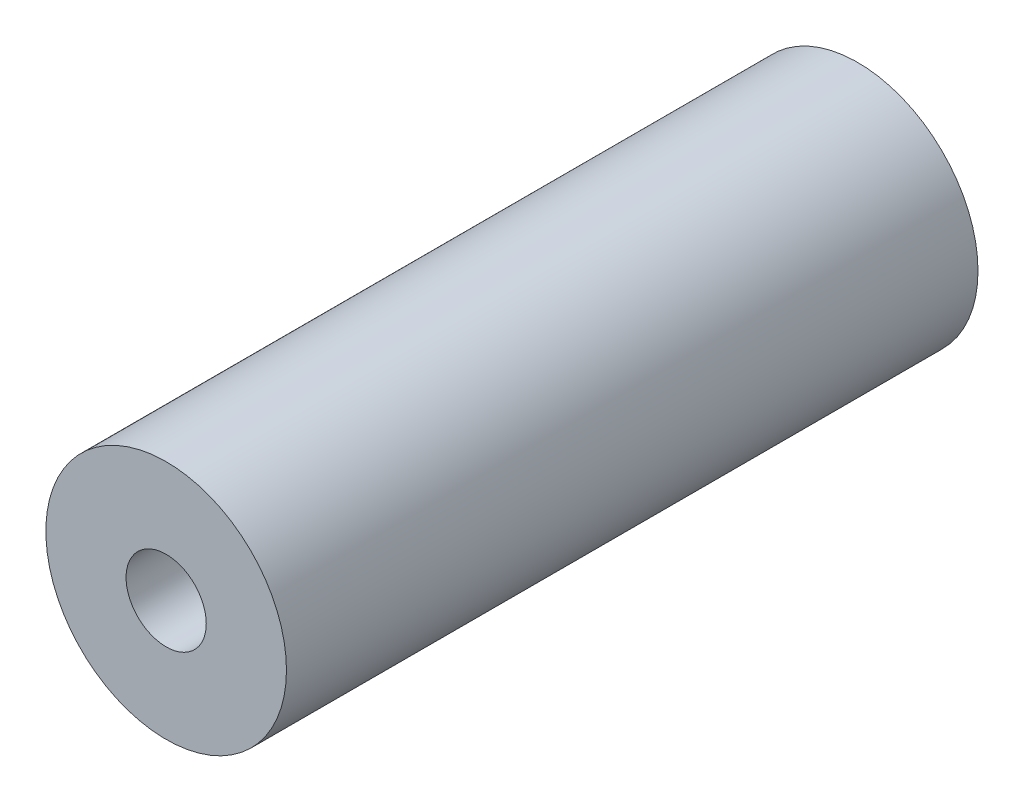
ISO-10303-21;
HEADER;
FILE_DESCRIPTION(('STEP AP214'),'2;1');
FILE_NAME('part.step','',(''),(''),'','','');
FILE_SCHEMA(('AUTOMOTIVE_DESIGN { 1 0 10303 214 1 1 1 1 }'));
ENDSEC;
DATA;
#1=APPLICATION_CONTEXT('core data for automotive mechanical design processes');
#2=APPLICATION_PROTOCOL_DEFINITION('international standard','automotive_design',2000,#1);
#3=PRODUCT_CONTEXT('',#1,'mechanical');
#4=PRODUCT('Part','Part','',(#3));
#5=PRODUCT_RELATED_PRODUCT_CATEGORY('part','',(#4));
#6=PRODUCT_DEFINITION_FORMATION('','',#4);
#7=PRODUCT_DEFINITION_CONTEXT('part definition',#1,'design');
#8=PRODUCT_DEFINITION('design','',#6,#7);
#9=PRODUCT_DEFINITION_SHAPE('','',#8);
#10=(LENGTH_UNIT() NAMED_UNIT(*) SI_UNIT(.MILLI.,.METRE.));
#11=(NAMED_UNIT(*) PLANE_ANGLE_UNIT() SI_UNIT($,.RADIAN.));
#12=(NAMED_UNIT(*) SI_UNIT($,.STERADIAN.) SOLID_ANGLE_UNIT());
#13=UNCERTAINTY_MEASURE_WITH_UNIT(LENGTH_MEASURE(1.E-05),#10,'distance_accuracy_value','');
#14=(GEOMETRIC_REPRESENTATION_CONTEXT(3) GLOBAL_UNCERTAINTY_ASSIGNED_CONTEXT((#13)) GLOBAL_UNIT_ASSIGNED_CONTEXT((#10,
#11,#12)) REPRESENTATION_CONTEXT('',''));
#15=CARTESIAN_POINT('',(0.,0.,0.));
#16=DIRECTION('',(0.,0.,1.));
#17=DIRECTION('',(1.,0.,0.));
#18=AXIS2_PLACEMENT_3D('',#15,#16,#17);
#19=CARTESIAN_POINT('',(0.,0.,54.75));
#20=DIRECTION('',(0.,0.,1.));
#21=DIRECTION('',(1.,0.,0.));
#22=AXIS2_PLACEMENT_3D('',#19,#20,#21);
#23=PLANE('',#22);
#24=CARTESIAN_POINT('',(0.,0.,54.75));
#25=DIRECTION('',(0.,0.,1.));
#26=DIRECTION('',(1.,0.,0.));
#27=AXIS2_PLACEMENT_3D('',#24,#25,#26);
#28=CIRCLE('',#27,19.05);
#29=CARTESIAN_POINT('',(19.05,0.,54.75));
#30=VERTEX_POINT('',#29);
#31=EDGE_CURVE('E10',#30,#30,#28,.T.);
#32=ORIENTED_EDGE('',*,*,#31,.T.);
#33=EDGE_LOOP('',(#32));
#34=FACE_BOUND('',#33,.T.);
#35=CARTESIAN_POINT('',(0.,0.,54.75));
#36=DIRECTION('',(0.,0.,1.));
#37=DIRECTION('',(1.,0.,0.));
#38=AXIS2_PLACEMENT_3D('',#35,#36,#37);
#39=CIRCLE('',#38,6.35);
#40=CARTESIAN_POINT('',(6.35,0.,54.75));
#41=VERTEX_POINT('',#40);
#42=EDGE_CURVE('E43',#41,#41,#39,.T.);
#43=ORIENTED_EDGE('',*,*,#42,.F.);
#44=EDGE_LOOP('',(#43));
#45=FACE_BOUND('',#44,.T.);
#46=ADVANCED_FACE('F32',(#34,#45),#23,.T.);
#47=CARTESIAN_POINT('',(0.,0.,-54.75));
#48=DIRECTION('',(0.,0.,1.));
#49=DIRECTION('',(1.,0.,0.));
#50=AXIS2_PLACEMENT_3D('',#47,#48,#49);
#51=PLANE('',#50);
#52=CARTESIAN_POINT('',(0.,0.,-54.75));
#53=DIRECTION('',(0.,0.,1.));
#54=DIRECTION('',(1.,0.,0.));
#55=AXIS2_PLACEMENT_3D('',#52,#53,#54);
#56=CIRCLE('',#55,19.05);
#57=CARTESIAN_POINT('',(19.05,0.,-54.75));
#58=VERTEX_POINT('',#57);
#59=EDGE_CURVE('E36',#58,#58,#56,.T.);
#60=ORIENTED_EDGE('',*,*,#59,.F.);
#61=EDGE_LOOP('',(#60));
#62=FACE_BOUND('',#61,.T.);
#63=CARTESIAN_POINT('',(0.,0.,-54.75));
#64=DIRECTION('',(0.,0.,1.));
#65=DIRECTION('',(1.,0.,0.));
#66=AXIS2_PLACEMENT_3D('',#63,#64,#65);
#67=CIRCLE('',#66,6.35);
#68=CARTESIAN_POINT('',(6.35,0.,-54.75));
#69=VERTEX_POINT('',#68);
#70=EDGE_CURVE('E45',#69,#69,#67,.T.);
#71=ORIENTED_EDGE('',*,*,#70,.T.);
#72=EDGE_LOOP('',(#71));
#73=FACE_BOUND('',#72,.T.);
#74=ADVANCED_FACE('F55',(#62,#73),#51,.F.);
#75=CARTESIAN_POINT('',(0.,0.,54.75));
#76=DIRECTION('',(0.,0.,-1.));
#77=DIRECTION('',(-1.,0.,0.));
#78=AXIS2_PLACEMENT_3D('',#75,#76,#77);
#79=CYLINDRICAL_SURFACE('',#78,19.05);
#80=ORIENTED_EDGE('',*,*,#31,.F.);
#81=EDGE_LOOP('',(#80));
#82=FACE_BOUND('',#81,.T.);
#83=ORIENTED_EDGE('',*,*,#59,.T.);
#84=EDGE_LOOP('',(#83));
#85=FACE_BOUND('',#84,.T.);
#86=ADVANCED_FACE('F34',(#82,#85),#79,.T.);
#87=CARTESIAN_POINT('',(0.,0.,54.75));
#88=DIRECTION('',(0.,0.,-1.));
#89=DIRECTION('',(-1.,0.,0.));
#90=AXIS2_PLACEMENT_3D('',#87,#88,#89);
#91=CYLINDRICAL_SURFACE('',#90,6.35);
#92=ORIENTED_EDGE('',*,*,#42,.T.);
#93=EDGE_LOOP('',(#92));
#94=FACE_BOUND('',#93,.T.);
#95=ORIENTED_EDGE('',*,*,#70,.F.);
#96=EDGE_LOOP('',(#95));
#97=FACE_BOUND('',#96,.T.);
#98=ADVANCED_FACE('F51',(#94,#97),#91,.F.);
#99=CLOSED_SHELL('',(#46,#74,#86,#98));
#100=MANIFOLD_SOLID_BREP('B2',#99);
#101=ADVANCED_BREP_SHAPE_REPRESENTATION('',(#18,#100),#14);
#102=SHAPE_DEFINITION_REPRESENTATION(#9,#101);
ENDSEC;
END-ISO-10303-21;
